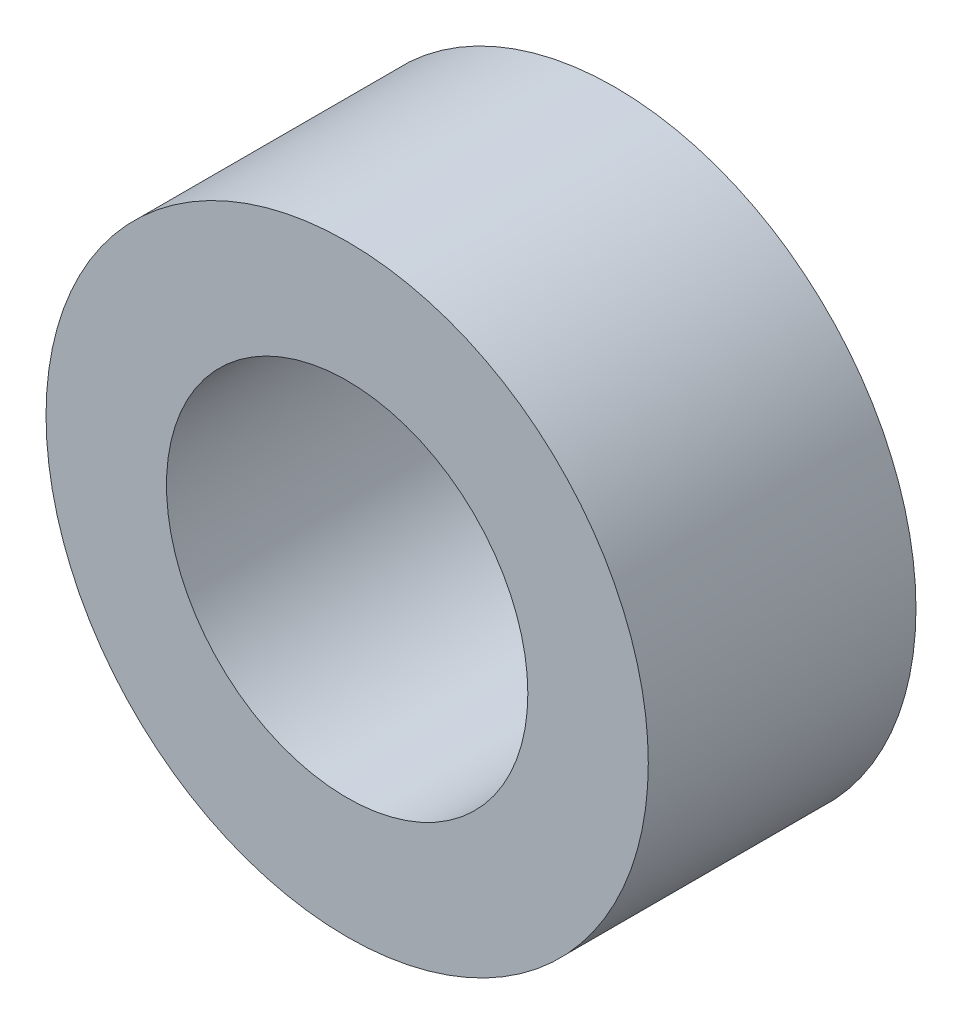
ISO-10303-21;
HEADER;
FILE_DESCRIPTION(('STEP AP214'),'2;1');
FILE_NAME('part.step','',(''),(''),'','','');
FILE_SCHEMA(('AUTOMOTIVE_DESIGN { 1 0 10303 214 1 1 1 1 }'));
ENDSEC;
DATA;
#1=APPLICATION_CONTEXT('core data for automotive mechanical design processes');
#2=APPLICATION_PROTOCOL_DEFINITION('international standard','automotive_design',2000,#1);
#3=PRODUCT_CONTEXT('',#1,'mechanical');
#4=PRODUCT('Part','Part','',(#3));
#5=PRODUCT_RELATED_PRODUCT_CATEGORY('part','',(#4));
#6=PRODUCT_DEFINITION_FORMATION('','',#4);
#7=PRODUCT_DEFINITION_CONTEXT('part definition',#1,'design');
#8=PRODUCT_DEFINITION('design','',#6,#7);
#9=PRODUCT_DEFINITION_SHAPE('','',#8);
#10=(LENGTH_UNIT() NAMED_UNIT(*) SI_UNIT(.MILLI.,.METRE.));
#11=(NAMED_UNIT(*) PLANE_ANGLE_UNIT() SI_UNIT($,.RADIAN.));
#12=(NAMED_UNIT(*) SI_UNIT($,.STERADIAN.) SOLID_ANGLE_UNIT());
#13=UNCERTAINTY_MEASURE_WITH_UNIT(LENGTH_MEASURE(1.E-05),#10,'distance_accuracy_value','');
#14=(GEOMETRIC_REPRESENTATION_CONTEXT(3) GLOBAL_UNCERTAINTY_ASSIGNED_CONTEXT((#13)) GLOBAL_UNIT_ASSIGNED_CONTEXT((#10,
#11,#12)) REPRESENTATION_CONTEXT('',''));
#15=CARTESIAN_POINT('',(0.,0.,0.));
#16=DIRECTION('',(0.,0.,1.));
#17=DIRECTION('',(1.,0.,0.));
#18=AXIS2_PLACEMENT_3D('',#15,#16,#17);
#19=CARTESIAN_POINT('',(0.,0.,1.));
#20=DIRECTION('',(0.,0.,1.));
#21=DIRECTION('',(1.,0.,0.));
#22=AXIS2_PLACEMENT_3D('',#19,#20,#21);
#23=PLANE('',#22);
#24=CARTESIAN_POINT('',(0.,0.,1.));
#25=DIRECTION('',(0.,0.,1.));
#26=DIRECTION('',(1.,0.,0.));
#27=AXIS2_PLACEMENT_3D('',#24,#25,#26);
#28=CIRCLE('',#27,2.25);
#29=CARTESIAN_POINT('',(2.25,0.,1.));
#30=VERTEX_POINT('',#29);
#31=EDGE_CURVE('E10',#30,#30,#28,.T.);
#32=ORIENTED_EDGE('',*,*,#31,.T.);
#33=EDGE_LOOP('',(#32));
#34=FACE_BOUND('',#33,.T.);
#35=CARTESIAN_POINT('',(0.,0.,1.));
#36=DIRECTION('',(0.,0.,1.));
#37=DIRECTION('',(1.,0.,0.));
#38=AXIS2_PLACEMENT_3D('',#35,#36,#37);
#39=CIRCLE('',#38,1.35);
#40=CARTESIAN_POINT('',(1.35,0.,1.));
#41=VERTEX_POINT('',#40);
#42=EDGE_CURVE('E45',#41,#41,#39,.T.);
#43=ORIENTED_EDGE('',*,*,#42,.F.);
#44=EDGE_LOOP('',(#43));
#45=FACE_BOUND('',#44,.T.);
#46=ADVANCED_FACE('F34',(#34,#45),#23,.T.);
#47=CARTESIAN_POINT('',(0.,0.,-1.));
#48=DIRECTION('',(0.,0.,1.));
#49=DIRECTION('',(1.,0.,0.));
#50=AXIS2_PLACEMENT_3D('',#47,#48,#49);
#51=PLANE('',#50);
#52=CARTESIAN_POINT('',(0.,0.,-1.));
#53=DIRECTION('',(0.,0.,1.));
#54=DIRECTION('',(1.,0.,0.));
#55=AXIS2_PLACEMENT_3D('',#52,#53,#54);
#56=CIRCLE('',#55,2.25);
#57=CARTESIAN_POINT('',(2.25,0.,-1.));
#58=VERTEX_POINT('',#57);
#59=EDGE_CURVE('E38',#58,#58,#56,.T.);
#60=ORIENTED_EDGE('',*,*,#59,.F.);
#61=EDGE_LOOP('',(#60));
#62=FACE_BOUND('',#61,.T.);
#63=CARTESIAN_POINT('',(0.,0.,-1.));
#64=DIRECTION('',(0.,0.,1.));
#65=DIRECTION('',(1.,0.,0.));
#66=AXIS2_PLACEMENT_3D('',#63,#64,#65);
#67=CIRCLE('',#66,1.35);
#68=CARTESIAN_POINT('',(1.35,0.,-1.));
#69=VERTEX_POINT('',#68);
#70=EDGE_CURVE('E47',#69,#69,#67,.T.);
#71=ORIENTED_EDGE('',*,*,#70,.T.);
#72=EDGE_LOOP('',(#71));
#73=FACE_BOUND('',#72,.T.);
#74=ADVANCED_FACE('F57',(#62,#73),#51,.F.);
#75=CARTESIAN_POINT('',(0.,0.,1.));
#76=DIRECTION('',(0.,0.,-1.));
#77=DIRECTION('',(-1.,0.,0.));
#78=AXIS2_PLACEMENT_3D('',#75,#76,#77);
#79=CYLINDRICAL_SURFACE('',#78,2.25);
#80=ORIENTED_EDGE('',*,*,#31,.F.);
#81=EDGE_LOOP('',(#80));
#82=FACE_BOUND('',#81,.T.);
#83=ORIENTED_EDGE('',*,*,#59,.T.);
#84=EDGE_LOOP('',(#83));
#85=FACE_BOUND('',#84,.T.);
#86=ADVANCED_FACE('F36',(#82,#85),#79,.T.);
#87=CARTESIAN_POINT('',(0.,0.,1.));
#88=DIRECTION('',(0.,0.,-1.));
#89=DIRECTION('',(-1.,0.,0.));
#90=AXIS2_PLACEMENT_3D('',#87,#88,#89);
#91=CYLINDRICAL_SURFACE('',#90,1.35);
#92=ORIENTED_EDGE('',*,*,#42,.T.);
#93=EDGE_LOOP('',(#92));
#94=FACE_BOUND('',#93,.T.);
#95=ORIENTED_EDGE('',*,*,#70,.F.);
#96=EDGE_LOOP('',(#95));
#97=FACE_BOUND('',#96,.T.);
#98=ADVANCED_FACE('F53',(#94,#97),#91,.F.);
#99=CLOSED_SHELL('',(#46,#74,#86,#98));
#100=MANIFOLD_SOLID_BREP('B2',#99);
#101=ADVANCED_BREP_SHAPE_REPRESENTATION('',(#18,#100),#14);
#102=SHAPE_DEFINITION_REPRESENTATION(#9,#101);
ENDSEC;
END-ISO-10303-21;
